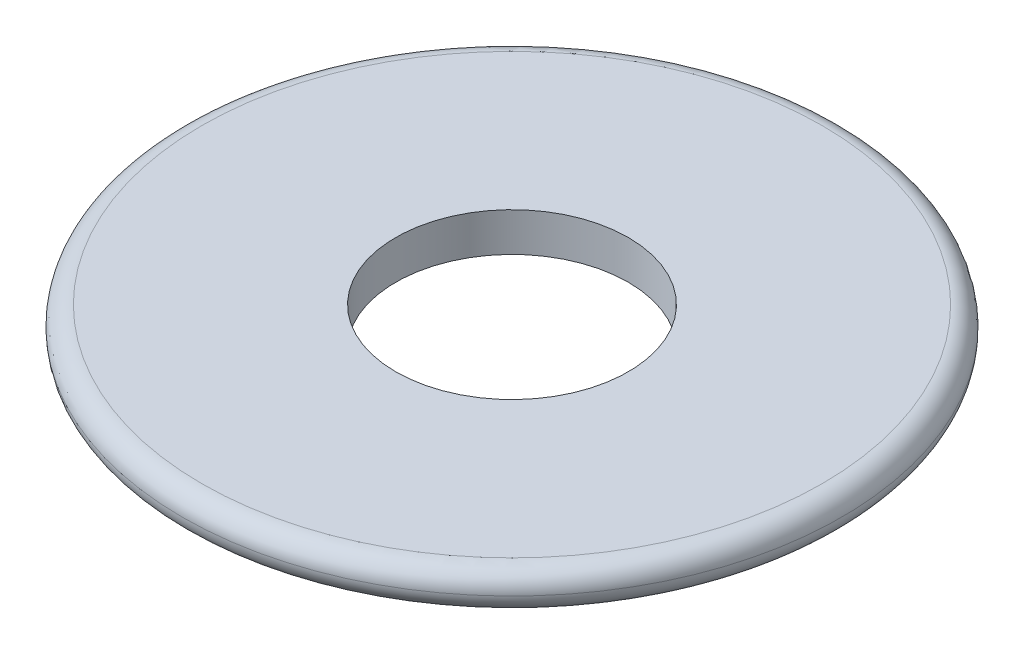
ISO-10303-21;
HEADER;
FILE_DESCRIPTION(('STEP AP214'),'2;1');
FILE_NAME('part.step','',(''),(''),'','','');
FILE_SCHEMA(('AUTOMOTIVE_DESIGN { 1 0 10303 214 1 1 1 1 }'));
ENDSEC;
DATA;
#1=APPLICATION_CONTEXT('core data for automotive mechanical design processes');
#2=APPLICATION_PROTOCOL_DEFINITION('international standard','automotive_design',2000,#1);
#3=PRODUCT_CONTEXT('',#1,'mechanical');
#4=PRODUCT('Part','Part','',(#3));
#5=PRODUCT_RELATED_PRODUCT_CATEGORY('part','',(#4));
#6=PRODUCT_DEFINITION_FORMATION('','',#4);
#7=PRODUCT_DEFINITION_CONTEXT('part definition',#1,'design');
#8=PRODUCT_DEFINITION('design','',#6,#7);
#9=PRODUCT_DEFINITION_SHAPE('','',#8);
#10=(LENGTH_UNIT() NAMED_UNIT(*) SI_UNIT(.MILLI.,.METRE.));
#11=(NAMED_UNIT(*) PLANE_ANGLE_UNIT() SI_UNIT($,.RADIAN.));
#12=(NAMED_UNIT(*) SI_UNIT($,.STERADIAN.) SOLID_ANGLE_UNIT());
#13=UNCERTAINTY_MEASURE_WITH_UNIT(LENGTH_MEASURE(1.E-05),#10,'distance_accuracy_value','');
#14=(GEOMETRIC_REPRESENTATION_CONTEXT(3) GLOBAL_UNCERTAINTY_ASSIGNED_CONTEXT((#13)) GLOBAL_UNIT_ASSIGNED_CONTEXT((#10,
#11,#12)) REPRESENTATION_CONTEXT('',''));
#15=CARTESIAN_POINT('',(0.,0.,0.));
#16=DIRECTION('',(0.,0.,1.));
#17=DIRECTION('',(1.,0.,0.));
#18=AXIS2_PLACEMENT_3D('',#15,#16,#17);
#19=CARTESIAN_POINT('',(0.,1.,0.));
#20=DIRECTION('',(0.,1.,0.));
#21=DIRECTION('',(0.,0.,1.));
#22=AXIS2_PLACEMENT_3D('',#19,#20,#21);
#23=PLANE('',#22);
#24=CARTESIAN_POINT('',(0.,1.,0.));
#25=DIRECTION('',(0.,1.,0.));
#26=DIRECTION('',(0.,0.,1.));
#27=AXIS2_PLACEMENT_3D('',#24,#25,#26);
#28=CIRCLE('',#27,8.);
#29=CARTESIAN_POINT('',(0.,1.,8.));
#30=VERTEX_POINT('',#29);
#31=EDGE_CURVE('E10',#30,#30,#28,.T.);
#32=ORIENTED_EDGE('',*,*,#31,.T.);
#33=EDGE_LOOP('',(#32));
#34=FACE_BOUND('',#33,.T.);
#35=CARTESIAN_POINT('',(0.,1.,0.));
#36=DIRECTION('',(0.,1.,0.));
#37=DIRECTION('',(0.,0.,1.));
#38=AXIS2_PLACEMENT_3D('',#35,#36,#37);
#39=CIRCLE('',#38,3.);
#40=CARTESIAN_POINT('',(0.,1.,3.));
#41=VERTEX_POINT('',#40);
#42=EDGE_CURVE('E43',#41,#41,#39,.T.);
#43=ORIENTED_EDGE('',*,*,#42,.F.);
#44=EDGE_LOOP('',(#43));
#45=FACE_BOUND('',#44,.T.);
#46=ADVANCED_FACE('F31',(#34,#45),#23,.T.);
#47=CARTESIAN_POINT('',(0.,0.,0.));
#48=DIRECTION('',(0.,1.,0.));
#49=DIRECTION('',(0.,0.,1.));
#50=AXIS2_PLACEMENT_3D('',#47,#48,#49);
#51=PLANE('',#50);
#52=CARTESIAN_POINT('',(0.,0.,0.));
#53=DIRECTION('',(0.,1.,0.));
#54=DIRECTION('',(0.,0.,1.));
#55=AXIS2_PLACEMENT_3D('',#52,#53,#54);
#56=CIRCLE('',#55,8.);
#57=CARTESIAN_POINT('',(0.,0.,8.));
#58=VERTEX_POINT('',#57);
#59=EDGE_CURVE('E39',#58,#58,#56,.F.);
#60=ORIENTED_EDGE('',*,*,#59,.T.);
#61=EDGE_LOOP('',(#60));
#62=FACE_BOUND('',#61,.T.);
#63=CARTESIAN_POINT('',(0.,0.,0.));
#64=DIRECTION('',(0.,1.,0.));
#65=DIRECTION('',(0.,0.,1.));
#66=AXIS2_PLACEMENT_3D('',#63,#64,#65);
#67=CIRCLE('',#66,3.);
#68=CARTESIAN_POINT('',(0.,0.,3.));
#69=VERTEX_POINT('',#68);
#70=EDGE_CURVE('E46',#69,#69,#67,.T.);
#71=ORIENTED_EDGE('',*,*,#70,.T.);
#72=EDGE_LOOP('',(#71));
#73=FACE_BOUND('',#72,.T.);
#74=ADVANCED_FACE('F56',(#62,#73),#51,.F.);
#75=CARTESIAN_POINT('',(0.,1.,0.));
#76=DIRECTION('',(0.,-1.,0.));
#77=DIRECTION('',(0.,0.,-1.));
#78=AXIS2_PLACEMENT_3D('',#75,#76,#77);
#79=CYLINDRICAL_SURFACE('',#78,3.);
#80=ORIENTED_EDGE('',*,*,#42,.T.);
#81=EDGE_LOOP('',(#80));
#82=FACE_BOUND('',#81,.T.);
#83=ORIENTED_EDGE('',*,*,#70,.F.);
#84=EDGE_LOOP('',(#83));
#85=FACE_BOUND('',#84,.T.);
#86=ADVANCED_FACE('F52',(#82,#85),#79,.F.);
#87=CARTESIAN_POINT('',(0.,0.5,0.));
#88=DIRECTION('',(0.,1.,0.));
#89=DIRECTION('',(0.,0.,1.));
#90=AXIS2_PLACEMENT_3D('',#87,#88,#89);
#91=TOROIDAL_SURFACE('',#90,8.,0.5);
#92=ORIENTED_EDGE('',*,*,#31,.F.);
#93=EDGE_LOOP('',(#92));
#94=FACE_BOUND('',#93,.T.);
#95=CARTESIAN_POINT('',(0.,0.5,0.));
#96=DIRECTION('',(0.,1.,0.));
#97=DIRECTION('',(0.,0.,1.));
#98=AXIS2_PLACEMENT_3D('',#95,#96,#97);
#99=CIRCLE('',#98,8.5);
#100=CARTESIAN_POINT('',(0.,0.5,8.5));
#101=VERTEX_POINT('',#100);
#102=EDGE_CURVE('E35',#101,#101,#99,.F.);
#103=ORIENTED_EDGE('',*,*,#102,.F.);
#104=EDGE_LOOP('',(#103));
#105=FACE_BOUND('',#104,.T.);
#106=ADVANCED_FACE('F33',(#94,#105),#91,.T.);
#107=CARTESIAN_POINT('',(0.,0.5,0.));
#108=DIRECTION('',(0.,1.,0.));
#109=DIRECTION('',(0.,0.,1.));
#110=AXIS2_PLACEMENT_3D('',#107,#108,#109);
#111=TOROIDAL_SURFACE('',#110,8.,0.5);
#112=ORIENTED_EDGE('',*,*,#59,.F.);
#113=EDGE_LOOP('',(#112));
#114=FACE_BOUND('',#113,.T.);
#115=ORIENTED_EDGE('',*,*,#102,.T.);
#116=EDGE_LOOP('',(#115));
#117=FACE_BOUND('',#116,.T.);
#118=ADVANCED_FACE('F64',(#114,#117),#111,.T.);
#119=CLOSED_SHELL('',(#46,#74,#86,#106,#118));
#120=MANIFOLD_SOLID_BREP('B2',#119);
#121=ADVANCED_BREP_SHAPE_REPRESENTATION('',(#18,#120),#14);
#122=SHAPE_DEFINITION_REPRESENTATION(#9,#121);
ENDSEC;
END-ISO-10303-21;
